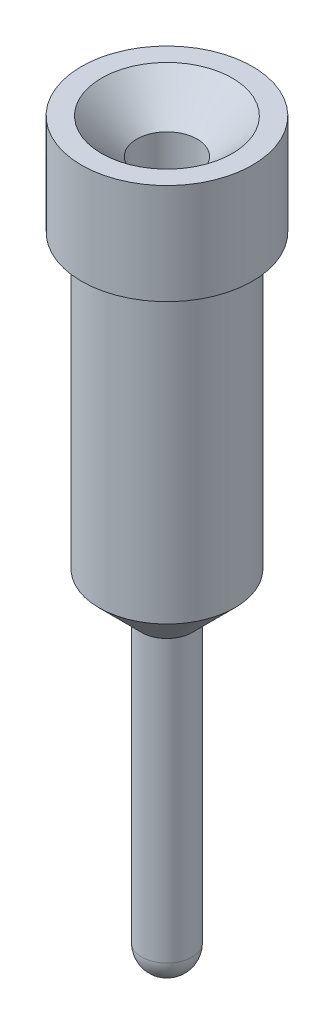
ISO-10303-21;
HEADER;
FILE_DESCRIPTION(('STEP AP214'),'2;1');
FILE_NAME('part.step','',(''),(''),'','','');
FILE_SCHEMA(('AUTOMOTIVE_DESIGN { 1 0 10303 214 1 1 1 1 }'));
ENDSEC;
DATA;
#1=APPLICATION_CONTEXT('core data for automotive mechanical design processes');
#2=APPLICATION_PROTOCOL_DEFINITION('international standard','automotive_design',2000,#1);
#3=PRODUCT_CONTEXT('',#1,'mechanical');
#4=PRODUCT('Part','Part','',(#3));
#5=PRODUCT_RELATED_PRODUCT_CATEGORY('part','',(#4));
#6=PRODUCT_DEFINITION_FORMATION('','',#4);
#7=PRODUCT_DEFINITION_CONTEXT('part definition',#1,'design');
#8=PRODUCT_DEFINITION('design','',#6,#7);
#9=PRODUCT_DEFINITION_SHAPE('','',#8);
#10=(LENGTH_UNIT() NAMED_UNIT(*) SI_UNIT(.MILLI.,.METRE.));
#11=(NAMED_UNIT(*) PLANE_ANGLE_UNIT() SI_UNIT($,.RADIAN.));
#12=(NAMED_UNIT(*) SI_UNIT($,.STERADIAN.) SOLID_ANGLE_UNIT());
#13=UNCERTAINTY_MEASURE_WITH_UNIT(LENGTH_MEASURE(1.E-05),#10,'distance_accuracy_value','');
#14=(GEOMETRIC_REPRESENTATION_CONTEXT(3) GLOBAL_UNCERTAINTY_ASSIGNED_CONTEXT((#13)) GLOBAL_UNIT_ASSIGNED_CONTEXT((#10,
#11,#12)) REPRESENTATION_CONTEXT('',''));
#15=CARTESIAN_POINT('',(0.,0.,0.));
#16=DIRECTION('',(0.,0.,1.));
#17=DIRECTION('',(1.,0.,0.));
#18=AXIS2_PLACEMENT_3D('',#15,#16,#17);
#19=CARTESIAN_POINT('',(-0.85,0.,0.));
#20=DIRECTION('',(0.,1.,0.));
#21=DIRECTION('',(0.,0.,1.));
#22=AXIS2_PLACEMENT_3D('',#19,#20,#21);
#23=PLANE('',#22);
#24=CARTESIAN_POINT('',(0.,0.,0.));
#25=DIRECTION('',(0.,1.,0.));
#26=DIRECTION('',(0.,0.,1.));
#27=AXIS2_PLACEMENT_3D('',#24,#25,#26);
#28=CIRCLE('',#27,0.85);
#29=CARTESIAN_POINT('',(0.,0.,0.85));
#30=VERTEX_POINT('',#29);
#31=EDGE_CURVE('E11',#30,#30,#28,.T.);
#32=ORIENTED_EDGE('',*,*,#31,.T.);
#33=EDGE_LOOP('',(#32));
#34=FACE_BOUND('',#33,.T.);
#35=CARTESIAN_POINT('',(0.,0.,0.));
#36=DIRECTION('',(0.,1.,0.));
#37=DIRECTION('',(0.,0.,1.));
#38=AXIS2_PLACEMENT_3D('',#35,#36,#37);
#39=CIRCLE('',#38,0.65);
#40=CARTESIAN_POINT('',(0.,0.,0.65));
#41=VERTEX_POINT('',#40);
#42=EDGE_CURVE('E56',#41,#41,#39,.T.);
#43=ORIENTED_EDGE('',*,*,#42,.F.);
#44=EDGE_LOOP('',(#43));
#45=FACE_BOUND('',#44,.T.);
#46=ADVANCED_FACE('F17',(#34,#45),#23,.T.);
#47=CARTESIAN_POINT('',(0.,28.992562867327,0.));
#48=DIRECTION('',(0.,1.,0.));
#49=DIRECTION('',(0.,0.,1.));
#50=AXIS2_PLACEMENT_3D('',#47,#48,#49);
#51=CYLINDRICAL_SURFACE('',#50,0.85);
#52=CARTESIAN_POINT('',(0.,-1.,0.));
#53=DIRECTION('',(0.,1.,0.));
#54=DIRECTION('',(0.,0.,1.));
#55=AXIS2_PLACEMENT_3D('',#52,#53,#54);
#56=CIRCLE('',#55,0.85);
#57=CARTESIAN_POINT('',(0.,-1.,0.85));
#58=VERTEX_POINT('',#57);
#59=EDGE_CURVE('E23',#58,#58,#56,.T.);
#60=ORIENTED_EDGE('',*,*,#59,.T.);
#61=EDGE_LOOP('',(#60));
#62=FACE_BOUND('',#61,.T.);
#63=ORIENTED_EDGE('',*,*,#31,.F.);
#64=EDGE_LOOP('',(#63));
#65=FACE_BOUND('',#64,.T.);
#66=ADVANCED_FACE('F45',(#62,#65),#51,.T.);
#67=CARTESIAN_POINT('',(-0.85,-1.,0.));
#68=DIRECTION('',(0.,-1.,0.));
#69=DIRECTION('',(0.,0.,-1.));
#70=AXIS2_PLACEMENT_3D('',#67,#68,#69);
#71=PLANE('',#70);
#72=CARTESIAN_POINT('',(0.,-1.,0.));
#73=DIRECTION('',(0.,1.,0.));
#74=DIRECTION('',(0.,0.,1.));
#75=AXIS2_PLACEMENT_3D('',#72,#73,#74);
#76=CIRCLE('',#75,0.675);
#77=CARTESIAN_POINT('',(0.,-1.,0.675));
#78=VERTEX_POINT('',#77);
#79=EDGE_CURVE('E74',#78,#78,#76,.T.);
#80=ORIENTED_EDGE('',*,*,#79,.T.);
#81=EDGE_LOOP('',(#80));
#82=FACE_BOUND('',#81,.T.);
#83=ORIENTED_EDGE('',*,*,#59,.F.);
#84=EDGE_LOOP('',(#83));
#85=FACE_BOUND('',#84,.T.);
#86=ADVANCED_FACE('F50',(#82,#85),#71,.T.);
#87=CARTESIAN_POINT('',(0.,28.992562867327,0.));
#88=DIRECTION('',(0.,1.,0.));
#89=DIRECTION('',(0.,0.,1.));
#90=AXIS2_PLACEMENT_3D('',#87,#88,#89);
#91=CYLINDRICAL_SURFACE('',#90,0.675);
#92=CARTESIAN_POINT('',(0.,-3.9,0.));
#93=DIRECTION('',(0.,1.,0.));
#94=DIRECTION('',(0.,0.,1.));
#95=AXIS2_PLACEMENT_3D('',#92,#93,#94);
#96=CIRCLE('',#95,0.675);
#97=CARTESIAN_POINT('',(0.,-3.9,0.675));
#98=VERTEX_POINT('',#97);
#99=EDGE_CURVE('E71',#98,#98,#96,.T.);
#100=ORIENTED_EDGE('',*,*,#99,.T.);
#101=EDGE_LOOP('',(#100));
#102=FACE_BOUND('',#101,.T.);
#103=ORIENTED_EDGE('',*,*,#79,.F.);
#104=EDGE_LOOP('',(#103));
#105=FACE_BOUND('',#104,.T.);
#106=ADVANCED_FACE('F81',(#102,#105),#91,.T.);
#107=CARTESIAN_POINT('',(0.,-3.9,0.));
#108=DIRECTION('',(0.,1.,0.));
#109=DIRECTION('',(0.,0.,1.));
#110=AXIS2_PLACEMENT_3D('',#107,#108,#109);
#111=CONICAL_SURFACE('',#110,0.675,0.785398163397453);
#112=CARTESIAN_POINT('',(0.,-4.325,0.));
#113=DIRECTION('',(0.,1.,0.));
#114=DIRECTION('',(0.,0.,1.));
#115=AXIS2_PLACEMENT_3D('',#112,#113,#114);
#116=CIRCLE('',#115,0.249999999999996);
#117=CARTESIAN_POINT('',(0.,-4.325,0.249999999999996));
#118=VERTEX_POINT('',#117);
#119=EDGE_CURVE('E68',#118,#118,#116,.T.);
#120=ORIENTED_EDGE('',*,*,#119,.T.);
#121=EDGE_LOOP('',(#120));
#122=FACE_BOUND('',#121,.T.);
#123=ORIENTED_EDGE('',*,*,#99,.F.);
#124=EDGE_LOOP('',(#123));
#125=FACE_BOUND('',#124,.T.);
#126=ADVANCED_FACE('F87',(#122,#125),#111,.T.);
#127=CARTESIAN_POINT('',(0.,28.992562867327,0.));
#128=DIRECTION('',(0.,1.,0.));
#129=DIRECTION('',(0.,0.,1.));
#130=AXIS2_PLACEMENT_3D('',#127,#128,#129);
#131=CYLINDRICAL_SURFACE('',#130,0.249999999999996);
#132=CARTESIAN_POINT('',(0.,-7.12,0.));
#133=DIRECTION('',(0.,1.,0.));
#134=DIRECTION('',(0.,0.,1.));
#135=AXIS2_PLACEMENT_3D('',#132,#133,#134);
#136=CIRCLE('',#135,0.249999999999996);
#137=CARTESIAN_POINT('',(0.,-7.12,0.249999999999996));
#138=VERTEX_POINT('',#137);
#139=EDGE_CURVE('E65',#138,#138,#136,.T.);
#140=ORIENTED_EDGE('',*,*,#139,.T.);
#141=EDGE_LOOP('',(#140));
#142=FACE_BOUND('',#141,.T.);
#143=ORIENTED_EDGE('',*,*,#119,.F.);
#144=EDGE_LOOP('',(#143));
#145=FACE_BOUND('',#144,.T.);
#146=ADVANCED_FACE('F40',(#142,#145),#131,.T.);
#147=CARTESIAN_POINT('',(0.,-7.12,0.));
#148=DIRECTION('',(0.,1.,0.));
#149=DIRECTION('',(-1.,0.,0.));
#150=AXIS2_PLACEMENT_3D('',#147,#148,#149);
#151=SPHERICAL_SURFACE('',#150,0.249999999999996);
#152=ORIENTED_EDGE('',*,*,#139,.F.);
#153=EDGE_LOOP('',(#152));
#154=FACE_BOUND('',#153,.T.);
#155=ADVANCED_FACE('F29',(#154),#151,.T.);
#156=CARTESIAN_POINT('',(0.,-4.,0.));
#157=DIRECTION('',(0.,1.,0.));
#158=DIRECTION('',(0.,0.,1.));
#159=AXIS2_PLACEMENT_3D('',#156,#157,#158);
#160=CONICAL_SURFACE('',#159,0.,0.785398163397442);
#161=CARTESIAN_POINT('',(0.,-3.7,0.));
#162=DIRECTION('',(0.,1.,0.));
#163=DIRECTION('',(0.,0.,1.));
#164=AXIS2_PLACEMENT_3D('',#161,#162,#163);
#165=CIRCLE('',#164,0.299999999999994);
#166=CARTESIAN_POINT('',(0.,-3.7,0.299999999999994));
#167=VERTEX_POINT('',#166);
#168=EDGE_CURVE('E61',#167,#167,#165,.T.);
#169=ORIENTED_EDGE('',*,*,#168,.T.);
#170=EDGE_LOOP('',(#169));
#171=FACE_BOUND('',#170,.T.);
#172=CARTESIAN_POINT('',(0.,-4.,0.));
#173=VERTEX_POINT('',#172);
#174=VERTEX_LOOP('',#173);
#175=FACE_BOUND('',#174,.T.);
#176=ADVANCED_FACE('F26',(#171,#175),#160,.F.);
#177=CARTESIAN_POINT('',(0.,28.992562867327,0.));
#178=DIRECTION('',(0.,1.,0.));
#179=DIRECTION('',(0.,0.,1.));
#180=AXIS2_PLACEMENT_3D('',#177,#178,#179);
#181=CYLINDRICAL_SURFACE('',#180,0.299999999999995);
#182=CARTESIAN_POINT('',(0.,-0.35,0.));
#183=DIRECTION('',(0.,1.,0.));
#184=DIRECTION('',(0.,0.,1.));
#185=AXIS2_PLACEMENT_3D('',#182,#183,#184);
#186=CIRCLE('',#185,0.299999999999996);
#187=CARTESIAN_POINT('',(0.,-0.35,0.299999999999996));
#188=VERTEX_POINT('',#187);
#189=EDGE_CURVE('E58',#188,#188,#186,.T.);
#190=ORIENTED_EDGE('',*,*,#189,.T.);
#191=EDGE_LOOP('',(#190));
#192=FACE_BOUND('',#191,.T.);
#193=ORIENTED_EDGE('',*,*,#168,.F.);
#194=EDGE_LOOP('',(#193));
#195=FACE_BOUND('',#194,.T.);
#196=ADVANCED_FACE('F28',(#192,#195),#181,.F.);
#197=CARTESIAN_POINT('',(0.,-0.35,0.));
#198=DIRECTION('',(0.,1.,0.));
#199=DIRECTION('',(0.,0.,1.));
#200=AXIS2_PLACEMENT_3D('',#197,#198,#199);
#201=CONICAL_SURFACE('',#200,0.299999999999996,0.785398163397446);
#202=ORIENTED_EDGE('',*,*,#42,.T.);
#203=EDGE_LOOP('',(#202));
#204=FACE_BOUND('',#203,.T.);
#205=ORIENTED_EDGE('',*,*,#189,.F.);
#206=EDGE_LOOP('',(#205));
#207=FACE_BOUND('',#206,.T.);
#208=ADVANCED_FACE('F37',(#204,#207),#201,.F.);
#209=CLOSED_SHELL('',(#46,#66,#86,#106,#126,#146,#155,#176,#196,#208));
#210=MANIFOLD_SOLID_BREP('B1',#209);
#211=ADVANCED_BREP_SHAPE_REPRESENTATION('',(#18,#210),#14);
#212=SHAPE_DEFINITION_REPRESENTATION(#9,#211);
ENDSEC;
END-ISO-10303-21;
